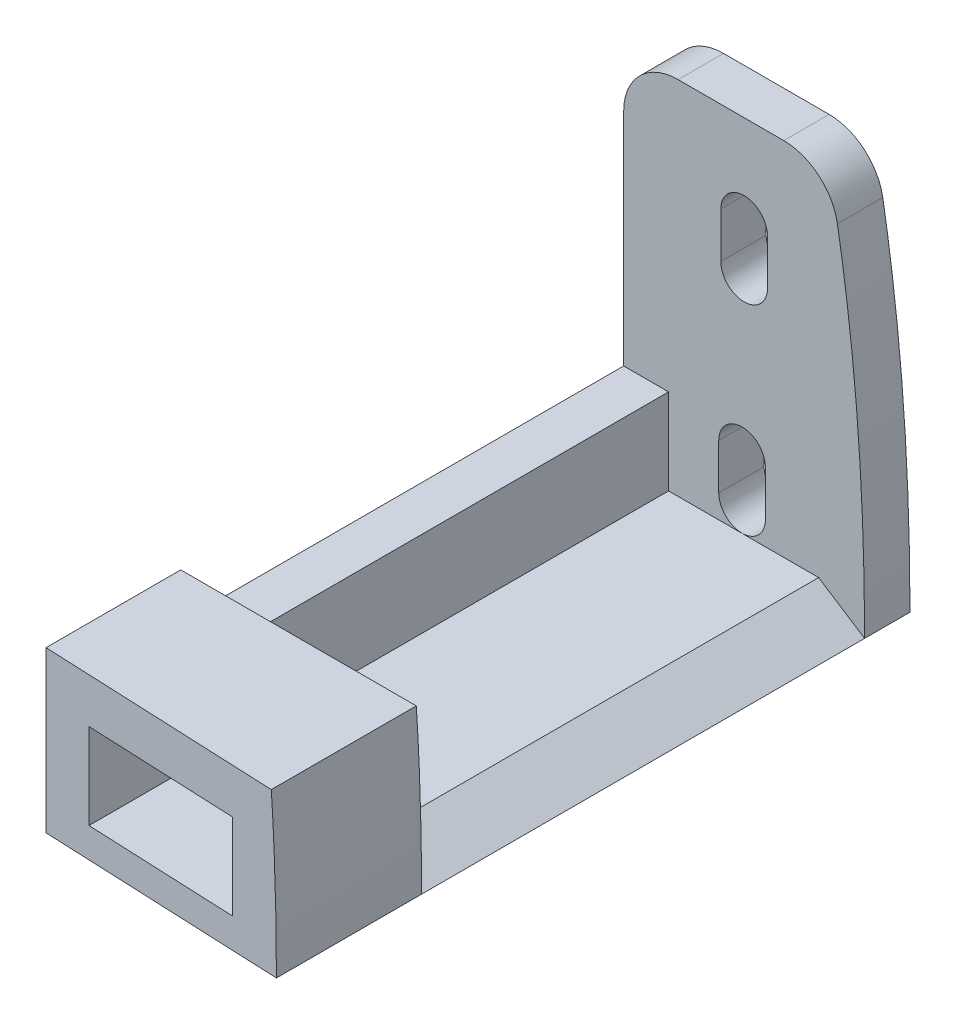
ISO-10303-21;
HEADER;
FILE_DESCRIPTION(('STEP AP214'),'2;1');
FILE_NAME('part.step','',(''),(''),'','','');
FILE_SCHEMA(('AUTOMOTIVE_DESIGN { 1 0 10303 214 1 1 1 1 }'));
ENDSEC;
DATA;
#1=APPLICATION_CONTEXT('core data for automotive mechanical design processes');
#2=APPLICATION_PROTOCOL_DEFINITION('international standard','automotive_design',2000,#1);
#3=PRODUCT_CONTEXT('',#1,'mechanical');
#4=PRODUCT('Part','Part','',(#3));
#5=PRODUCT_RELATED_PRODUCT_CATEGORY('part','',(#4));
#6=PRODUCT_DEFINITION_FORMATION('','',#4);
#7=PRODUCT_DEFINITION_CONTEXT('part definition',#1,'design');
#8=PRODUCT_DEFINITION('design','',#6,#7);
#9=PRODUCT_DEFINITION_SHAPE('','',#8);
#10=(LENGTH_UNIT() NAMED_UNIT(*) SI_UNIT(.MILLI.,.METRE.));
#11=(NAMED_UNIT(*) PLANE_ANGLE_UNIT() SI_UNIT($,.RADIAN.));
#12=(NAMED_UNIT(*) SI_UNIT($,.STERADIAN.) SOLID_ANGLE_UNIT());
#13=UNCERTAINTY_MEASURE_WITH_UNIT(LENGTH_MEASURE(1.E-05),#10,'distance_accuracy_value','');
#14=(GEOMETRIC_REPRESENTATION_CONTEXT(3) GLOBAL_UNCERTAINTY_ASSIGNED_CONTEXT((#13)) GLOBAL_UNIT_ASSIGNED_CONTEXT((#10,
#11,#12)) REPRESENTATION_CONTEXT('',''));
#15=CARTESIAN_POINT('',(0.,0.,0.));
#16=DIRECTION('',(0.,0.,1.));
#17=DIRECTION('',(1.,0.,0.));
#18=AXIS2_PLACEMENT_3D('',#15,#16,#17);
#19=CARTESIAN_POINT('',(0.,0.,0.));
#20=DIRECTION('',(0.,1.,0.));
#21=DIRECTION('',(-1.,0.,0.));
#22=AXIS2_PLACEMENT_3D('',#19,#20,#21);
#23=PLANE('',#22);
#24=DIRECTION('',(0.,0.,-1.));
#25=VECTOR('',#24,1.);
#26=CARTESIAN_POINT('',(76.7012027386837,0.,115.300012591128));
#27=LINE('',#26,#25);
#28=CARTESIAN_POINT('',(76.7012027386837,0.,34.165));
#29=VERTEX_POINT('',#28);
#30=CARTESIAN_POINT('',(76.7012027386837,0.,3.175));
#31=VERTEX_POINT('',#30);
#32=EDGE_CURVE('E229',#29,#31,#27,.T.);
#33=ORIENTED_EDGE('',*,*,#32,.F.);
#34=DIRECTION('',(0.,0.,1.));
#35=VECTOR('',#34,1.);
#36=CARTESIAN_POINT('',(76.7012027386837,0.,34.165));
#37=LINE('',#36,#35);
#38=CARTESIAN_POINT('',(76.7012027386837,1.90819582357449E-13,44.325));
#39=VERTEX_POINT('',#38);
#40=EDGE_CURVE('E12',#29,#39,#37,.T.);
#41=ORIENTED_EDGE('',*,*,#40,.T.);
#42=DIRECTION('',(0.999048221581858,0.,0.0436193873653289));
#43=VECTOR('',#42,1.);
#44=CARTESIAN_POINT('',(76.7012027386833,4.47558656802016E-13,44.325));
#45=LINE('',#44,#43);
#46=CARTESIAN_POINT('',(59.8466043155287,3.98986399474666E-13,43.5891123405009));
#47=VERTEX_POINT('',#46);
#48=EDGE_CURVE('E55',#47,#39,#45,.T.);
#49=ORIENTED_EDGE('',*,*,#48,.F.);
#50=DIRECTION('',(0.,0.,1.));
#51=VECTOR('',#50,1.);
#52=CARTESIAN_POINT('',(59.8466043155288,3.50414142147315E-13,3.175));
#53=LINE('',#52,#51);
#54=CARTESIAN_POINT('',(59.8466043155288,3.57353036051222E-13,0.));
#55=VERTEX_POINT('',#54);
#56=EDGE_CURVE('E203',#55,#47,#53,.T.);
#57=ORIENTED_EDGE('',*,*,#56,.F.);
#58=DIRECTION('',(-1.,0.,0.));
#59=VECTOR('',#58,1.);
#60=CARTESIAN_POINT('',(68.7014275349849,4.02455846426619E-13,0.));
#61=LINE('',#60,#59);
#62=CARTESIAN_POINT('',(76.7012027386837,0.,0.));
#63=VERTEX_POINT('',#62);
#64=EDGE_CURVE('E43',#63,#55,#61,.T.);
#65=ORIENTED_EDGE('',*,*,#64,.F.);
#66=DIRECTION('',(0.,0.,-1.));
#67=VECTOR('',#66,1.);
#68=CARTESIAN_POINT('',(76.7012027386837,0.,3.175));
#69=LINE('',#68,#67);
#70=EDGE_CURVE('E456',#31,#63,#69,.T.);
#71=ORIENTED_EDGE('',*,*,#70,.F.);
#72=EDGE_LOOP('',(#33,#41,#49,#57,#65,#71));
#73=FACE_BOUND('',#72,.T.);
#74=ADVANCED_FACE('F40',(#73),#23,.F.);
#75=CARTESIAN_POINT('',(69.760991774147,6.89682177302465,3.175));
#76=DIRECTION('',(-1.,0.,0.));
#77=DIRECTION('',(0.,0.,1.));
#78=AXIS2_PLACEMENT_3D('',#75,#76,#77);
#79=PLANE('',#78);
#80=DIRECTION('',(0.,1.,0.));
#81=VECTOR('',#80,1.);
#82=CARTESIAN_POINT('',(69.760991774147,6.89682177302465,0.));
#83=LINE('',#82,#81);
#84=CARTESIAN_POINT('',(69.760991774147,3.72182177302465,0.));
#85=VERTEX_POINT('',#84);
#86=CARTESIAN_POINT('',(69.760991774147,6.89682177302465,0.));
#87=VERTEX_POINT('',#86);
#88=EDGE_CURVE('E258',#85,#87,#83,.T.);
#89=ORIENTED_EDGE('',*,*,#88,.F.);
#90=DIRECTION('',(0.,0.,-1.));
#91=VECTOR('',#90,1.);
#92=CARTESIAN_POINT('',(69.760991774147,3.72182177302465,3.175));
#93=LINE('',#92,#91);
#94=CARTESIAN_POINT('',(69.760991774147,3.72182177302465,3.175));
#95=VERTEX_POINT('',#94);
#96=EDGE_CURVE('E278',#95,#85,#93,.T.);
#97=ORIENTED_EDGE('',*,*,#96,.F.);
#98=DIRECTION('',(0.,1.,0.));
#99=VECTOR('',#98,1.);
#100=CARTESIAN_POINT('',(69.760991774147,6.89682177302465,3.175));
#101=LINE('',#100,#99);
#102=CARTESIAN_POINT('',(69.760991774147,6.89682177302465,3.175));
#103=VERTEX_POINT('',#102);
#104=EDGE_CURVE('E263',#95,#103,#101,.T.);
#105=ORIENTED_EDGE('',*,*,#104,.T.);
#106=DIRECTION('',(0.,0.,-1.));
#107=VECTOR('',#106,1.);
#108=CARTESIAN_POINT('',(69.760991774147,6.89682177302465,3.175));
#109=LINE('',#108,#107);
#110=EDGE_CURVE('E265',#103,#87,#109,.T.);
#111=ORIENTED_EDGE('',*,*,#110,.T.);
#112=EDGE_LOOP('',(#89,#97,#105,#111));
#113=FACE_BOUND('',#112,.T.);
#114=ADVANCED_FACE('F385',(#113),#79,.T.);
#115=CARTESIAN_POINT('',(68.129041774147,3.72182177302465,3.175));
#116=DIRECTION('',(0.,0.,-1.));
#117=DIRECTION('',(-1.,0.,0.));
#118=AXIS2_PLACEMENT_3D('',#115,#116,#117);
#119=CYLINDRICAL_SURFACE('',#118,1.63194999999999);
#120=CARTESIAN_POINT('',(68.129041774147,3.72182177302465,0.));
#121=DIRECTION('',(0.,0.,1.));
#122=DIRECTION('',(-1.,0.,0.));
#123=AXIS2_PLACEMENT_3D('',#120,#121,#122);
#124=CIRCLE('',#123,1.63194999999999);
#125=CARTESIAN_POINT('',(66.497091774147,3.72182177302465,0.));
#126=VERTEX_POINT('',#125);
#127=EDGE_CURVE('E271',#126,#85,#124,.T.);
#128=ORIENTED_EDGE('',*,*,#127,.F.);
#129=DIRECTION('',(0.,0.,-1.));
#130=VECTOR('',#129,1.);
#131=CARTESIAN_POINT('',(66.497091774147,3.72182177302465,3.175));
#132=LINE('',#131,#130);
#133=CARTESIAN_POINT('',(66.497091774147,3.72182177302465,3.175));
#134=VERTEX_POINT('',#133);
#135=EDGE_CURVE('E280',#134,#126,#132,.T.);
#136=ORIENTED_EDGE('',*,*,#135,.F.);
#137=CARTESIAN_POINT('',(68.129041774147,3.72182177302465,3.175));
#138=DIRECTION('',(0.,0.,1.));
#139=DIRECTION('',(-1.,0.,0.));
#140=AXIS2_PLACEMENT_3D('',#137,#138,#139);
#141=CIRCLE('',#140,1.63194999999999);
#142=EDGE_CURVE('E260',#134,#95,#141,.T.);
#143=ORIENTED_EDGE('',*,*,#142,.T.);
#144=ORIENTED_EDGE('',*,*,#96,.T.);
#145=EDGE_LOOP('',(#128,#136,#143,#144));
#146=FACE_BOUND('',#145,.T.);
#147=ADVANCED_FACE('F381',(#146),#119,.F.);
#148=CARTESIAN_POINT('',(66.497091774147,6.89682177302465,3.175));
#149=DIRECTION('',(1.,0.,0.));
#150=DIRECTION('',(0.,0.,-1.));
#151=AXIS2_PLACEMENT_3D('',#148,#149,#150);
#152=PLANE('',#151);
#153=DIRECTION('',(0.,-1.,0.));
#154=VECTOR('',#153,1.);
#155=CARTESIAN_POINT('',(66.497091774147,6.89682177302465,0.));
#156=LINE('',#155,#154);
#157=CARTESIAN_POINT('',(66.497091774147,6.89682177302465,0.));
#158=VERTEX_POINT('',#157);
#159=EDGE_CURVE('E268',#158,#126,#156,.T.);
#160=ORIENTED_EDGE('',*,*,#159,.F.);
#161=DIRECTION('',(0.,0.,-1.));
#162=VECTOR('',#161,1.);
#163=CARTESIAN_POINT('',(66.497091774147,6.89682177302465,3.175));
#164=LINE('',#163,#162);
#165=CARTESIAN_POINT('',(66.497091774147,6.89682177302465,3.175));
#166=VERTEX_POINT('',#165);
#167=EDGE_CURVE('E282',#166,#158,#164,.T.);
#168=ORIENTED_EDGE('',*,*,#167,.F.);
#169=DIRECTION('',(0.,-1.,0.));
#170=VECTOR('',#169,1.);
#171=CARTESIAN_POINT('',(66.497091774147,6.89682177302465,3.175));
#172=LINE('',#171,#170);
#173=EDGE_CURVE('E257',#166,#134,#172,.T.);
#174=ORIENTED_EDGE('',*,*,#173,.T.);
#175=ORIENTED_EDGE('',*,*,#135,.T.);
#176=EDGE_LOOP('',(#160,#168,#174,#175));
#177=FACE_BOUND('',#176,.T.);
#178=ADVANCED_FACE('F377',(#177),#152,.T.);
#179=CARTESIAN_POINT('',(68.129041774147,6.89682177302465,3.175));
#180=DIRECTION('',(0.,0.,-1.));
#181=DIRECTION('',(-1.,0.,0.));
#182=AXIS2_PLACEMENT_3D('',#179,#180,#181);
#183=CYLINDRICAL_SURFACE('',#182,1.63194999999999);
#184=CARTESIAN_POINT('',(68.129041774147,6.89682177302465,0.));
#185=DIRECTION('',(0.,0.,1.));
#186=DIRECTION('',(-1.,0.,0.));
#187=AXIS2_PLACEMENT_3D('',#184,#185,#186);
#188=CIRCLE('',#187,1.63194999999999);
#189=EDGE_CURVE('E244',#87,#158,#188,.T.);
#190=ORIENTED_EDGE('',*,*,#189,.F.);
#191=ORIENTED_EDGE('',*,*,#110,.F.);
#192=CARTESIAN_POINT('',(68.129041774147,6.89682177302465,3.175));
#193=DIRECTION('',(0.,0.,1.));
#194=DIRECTION('',(-1.,0.,0.));
#195=AXIS2_PLACEMENT_3D('',#192,#193,#194);
#196=CIRCLE('',#195,1.63194999999999);
#197=EDGE_CURVE('E255',#103,#166,#196,.T.);
#198=ORIENTED_EDGE('',*,*,#197,.T.);
#199=ORIENTED_EDGE('',*,*,#167,.T.);
#200=EDGE_LOOP('',(#190,#191,#198,#199));
#201=FACE_BOUND('',#200,.T.);
#202=ADVANCED_FACE('F344',(#201),#183,.F.);
#203=CARTESIAN_POINT('',(71.0455447158619,27.3353946469676,3.175));
#204=DIRECTION('',(0.,-1.,0.));
#205=DIRECTION('',(1.,0.,0.));
#206=AXIS2_PLACEMENT_3D('',#203,#204,#205);
#207=PLANE('',#206);
#208=DIRECTION('',(-1.,0.,0.));
#209=VECTOR('',#208,1.);
#210=CARTESIAN_POINT('',(71.0455447158619,27.3353946469676,0.));
#211=LINE('',#210,#209);
#212=CARTESIAN_POINT('',(71.0455447158619,27.3353946469676,0.));
#213=VERTEX_POINT('',#212);
#214=CARTESIAN_POINT('',(63.6566043155288,27.3353946469676,0.));
#215=VERTEX_POINT('',#214);
#216=EDGE_CURVE('E508',#213,#215,#211,.T.);
#217=ORIENTED_EDGE('',*,*,#216,.T.);
#218=DIRECTION('',(0.,0.,-1.));
#219=VECTOR('',#218,1.);
#220=CARTESIAN_POINT('',(63.6566043155288,27.3353946469676,3.175));
#221=LINE('',#220,#219);
#222=CARTESIAN_POINT('',(63.6566043155288,27.3353946469676,3.175));
#223=VERTEX_POINT('',#222);
#224=EDGE_CURVE('E498',#223,#215,#221,.T.);
#225=ORIENTED_EDGE('',*,*,#224,.F.);
#226=DIRECTION('',(-1.,0.,0.));
#227=VECTOR('',#226,1.);
#228=CARTESIAN_POINT('',(71.0455447158619,27.3353946469676,3.175));
#229=LINE('',#228,#227);
#230=CARTESIAN_POINT('',(71.0455447158619,27.3353946469676,3.175));
#231=VERTEX_POINT('',#230);
#232=EDGE_CURVE('E526',#231,#223,#229,.T.);
#233=ORIENTED_EDGE('',*,*,#232,.F.);
#234=DIRECTION('',(0.,0.,-1.));
#235=VECTOR('',#234,1.);
#236=CARTESIAN_POINT('',(71.0455447158619,27.3353946469676,3.175));
#237=LINE('',#236,#235);
#238=EDGE_CURVE('E494',#231,#213,#237,.T.);
#239=ORIENTED_EDGE('',*,*,#238,.T.);
#240=EDGE_LOOP('',(#217,#225,#233,#239));
#241=FACE_BOUND('',#240,.T.);
#242=ADVANCED_FACE('F340',(#241),#207,.F.);
#243=CARTESIAN_POINT('',(69.9058535271063,20.9853946469675,3.175));
#244=DIRECTION('',(-1.,0.,0.));
#245=DIRECTION('',(0.,0.,1.));
#246=AXIS2_PLACEMENT_3D('',#243,#244,#245);
#247=PLANE('',#246);
#248=DIRECTION('',(0.,1.,0.));
#249=VECTOR('',#248,1.);
#250=CARTESIAN_POINT('',(69.9058535271063,20.9853946469675,0.));
#251=LINE('',#250,#249);
#252=CARTESIAN_POINT('',(69.9058535271063,17.8103946469675,0.));
#253=VERTEX_POINT('',#252);
#254=CARTESIAN_POINT('',(69.9058535271063,20.9853946469675,0.));
#255=VERTEX_POINT('',#254);
#256=EDGE_CURVE('E289',#253,#255,#251,.T.);
#257=ORIENTED_EDGE('',*,*,#256,.F.);
#258=DIRECTION('',(0.,0.,-1.));
#259=VECTOR('',#258,1.);
#260=CARTESIAN_POINT('',(69.9058535271063,17.8103946469675,3.175));
#261=LINE('',#260,#259);
#262=CARTESIAN_POINT('',(69.9058535271063,17.8103946469675,3.175));
#263=VERTEX_POINT('',#262);
#264=EDGE_CURVE('E309',#263,#253,#261,.T.);
#265=ORIENTED_EDGE('',*,*,#264,.F.);
#266=DIRECTION('',(0.,1.,0.));
#267=VECTOR('',#266,1.);
#268=CARTESIAN_POINT('',(69.9058535271063,20.9853946469675,3.175));
#269=LINE('',#268,#267);
#270=CARTESIAN_POINT('',(69.9058535271063,20.9853946469675,3.175));
#271=VERTEX_POINT('',#270);
#272=EDGE_CURVE('E294',#263,#271,#269,.T.);
#273=ORIENTED_EDGE('',*,*,#272,.T.);
#274=DIRECTION('',(0.,0.,-1.));
#275=VECTOR('',#274,1.);
#276=CARTESIAN_POINT('',(69.9058535271063,20.9853946469675,3.175));
#277=LINE('',#276,#275);
#278=EDGE_CURVE('E296',#271,#255,#277,.T.);
#279=ORIENTED_EDGE('',*,*,#278,.T.);
#280=EDGE_LOOP('',(#257,#265,#273,#279));
#281=FACE_BOUND('',#280,.T.);
#282=ADVANCED_FACE('F343',(#281),#247,.T.);
#283=CARTESIAN_POINT('',(68.2739035271063,17.8103946469675,3.175));
#284=DIRECTION('',(0.,0.,-1.));
#285=DIRECTION('',(-1.,0.,0.));
#286=AXIS2_PLACEMENT_3D('',#283,#284,#285);
#287=CYLINDRICAL_SURFACE('',#286,1.63194999999999);
#288=CARTESIAN_POINT('',(68.2739035271063,17.8103946469675,0.));
#289=DIRECTION('',(0.,0.,1.));
#290=DIRECTION('',(-1.,0.,0.));
#291=AXIS2_PLACEMENT_3D('',#288,#289,#290);
#292=CIRCLE('',#291,1.63194999999999);
#293=CARTESIAN_POINT('',(66.6419535271063,17.8103946469675,0.));
#294=VERTEX_POINT('',#293);
#295=EDGE_CURVE('E302',#294,#253,#292,.T.);
#296=ORIENTED_EDGE('',*,*,#295,.F.);
#297=DIRECTION('',(0.,0.,-1.));
#298=VECTOR('',#297,1.);
#299=CARTESIAN_POINT('',(66.6419535271063,17.8103946469675,3.175));
#300=LINE('',#299,#298);
#301=CARTESIAN_POINT('',(66.6419535271063,17.8103946469675,3.175));
#302=VERTEX_POINT('',#301);
#303=EDGE_CURVE('E311',#302,#294,#300,.T.);
#304=ORIENTED_EDGE('',*,*,#303,.F.);
#305=CARTESIAN_POINT('',(68.2739035271063,17.8103946469675,3.175));
#306=DIRECTION('',(0.,0.,1.));
#307=DIRECTION('',(-1.,0.,0.));
#308=AXIS2_PLACEMENT_3D('',#305,#306,#307);
#309=CIRCLE('',#308,1.63194999999999);
#310=EDGE_CURVE('E291',#302,#263,#309,.T.);
#311=ORIENTED_EDGE('',*,*,#310,.T.);
#312=ORIENTED_EDGE('',*,*,#264,.T.);
#313=EDGE_LOOP('',(#296,#304,#311,#312));
#314=FACE_BOUND('',#313,.T.);
#315=ADVANCED_FACE('F367',(#314),#287,.F.);
#316=CARTESIAN_POINT('',(66.6419535271063,20.9853946469675,3.175));
#317=DIRECTION('',(1.,0.,0.));
#318=DIRECTION('',(0.,0.,-1.));
#319=AXIS2_PLACEMENT_3D('',#316,#317,#318);
#320=PLANE('',#319);
#321=DIRECTION('',(0.,-1.,0.));
#322=VECTOR('',#321,1.);
#323=CARTESIAN_POINT('',(66.6419535271063,20.9853946469675,0.));
#324=LINE('',#323,#322);
#325=CARTESIAN_POINT('',(66.6419535271063,20.9853946469675,0.));
#326=VERTEX_POINT('',#325);
#327=EDGE_CURVE('E299',#326,#294,#324,.T.);
#328=ORIENTED_EDGE('',*,*,#327,.F.);
#329=DIRECTION('',(0.,0.,-1.));
#330=VECTOR('',#329,1.);
#331=CARTESIAN_POINT('',(66.6419535271063,20.9853946469675,3.175));
#332=LINE('',#331,#330);
#333=CARTESIAN_POINT('',(66.6419535271063,20.9853946469675,3.175));
#334=VERTEX_POINT('',#333);
#335=EDGE_CURVE('E313',#334,#326,#332,.T.);
#336=ORIENTED_EDGE('',*,*,#335,.F.);
#337=DIRECTION('',(0.,-1.,0.));
#338=VECTOR('',#337,1.);
#339=CARTESIAN_POINT('',(66.6419535271063,20.9853946469675,3.175));
#340=LINE('',#339,#338);
#341=EDGE_CURVE('E288',#334,#302,#340,.T.);
#342=ORIENTED_EDGE('',*,*,#341,.T.);
#343=ORIENTED_EDGE('',*,*,#303,.T.);
#344=EDGE_LOOP('',(#328,#336,#342,#343));
#345=FACE_BOUND('',#344,.T.);
#346=ADVANCED_FACE('F363',(#345),#320,.T.);
#347=CARTESIAN_POINT('',(68.2739035271063,20.9853946469675,3.175));
#348=DIRECTION('',(0.,0.,-1.));
#349=DIRECTION('',(-1.,0.,0.));
#350=AXIS2_PLACEMENT_3D('',#347,#348,#349);
#351=CYLINDRICAL_SURFACE('',#350,1.63194999999999);
#352=CARTESIAN_POINT('',(68.2739035271063,20.9853946469675,0.));
#353=DIRECTION('',(0.,0.,1.));
#354=DIRECTION('',(-1.,0.,0.));
#355=AXIS2_PLACEMENT_3D('',#352,#353,#354);
#356=CIRCLE('',#355,1.63194999999999);
#357=EDGE_CURVE('E285',#255,#326,#356,.T.);
#358=ORIENTED_EDGE('',*,*,#357,.F.);
#359=ORIENTED_EDGE('',*,*,#278,.F.);
#360=CARTESIAN_POINT('',(68.2739035271063,20.9853946469675,3.175));
#361=DIRECTION('',(0.,0.,1.));
#362=DIRECTION('',(-1.,0.,0.));
#363=AXIS2_PLACEMENT_3D('',#360,#361,#362);
#364=CIRCLE('',#363,1.63194999999999);
#365=EDGE_CURVE('E286',#271,#334,#364,.T.);
#366=ORIENTED_EDGE('',*,*,#365,.T.);
#367=ORIENTED_EDGE('',*,*,#335,.T.);
#368=EDGE_LOOP('',(#358,#359,#366,#367));
#369=FACE_BOUND('',#368,.T.);
#370=ADVANCED_FACE('F350',(#369),#351,.F.);
#371=CARTESIAN_POINT('',(63.6566043155288,23.5253946469676,3.175));
#372=DIRECTION('',(0.,0.,-1.));
#373=DIRECTION('',(-1.,0.,0.));
#374=AXIS2_PLACEMENT_3D('',#371,#372,#373);
#375=CYLINDRICAL_SURFACE('',#374,3.81);
#376=CARTESIAN_POINT('',(63.6566043155288,23.5253946469676,0.));
#377=DIRECTION('',(0.,0.,1.));
#378=DIRECTION('',(1.,0.,0.));
#379=AXIS2_PLACEMENT_3D('',#376,#377,#378);
#380=CIRCLE('',#379,3.81);
#381=CARTESIAN_POINT('',(59.8466043155288,23.5253946469675,0.));
#382=VERTEX_POINT('',#381);
#383=EDGE_CURVE('E506',#215,#382,#380,.T.);
#384=ORIENTED_EDGE('',*,*,#383,.T.);
#385=DIRECTION('',(0.,0.,-1.));
#386=VECTOR('',#385,1.);
#387=CARTESIAN_POINT('',(59.8466043155288,23.5253946469675,3.175));
#388=LINE('',#387,#386);
#389=CARTESIAN_POINT('',(59.8466043155288,23.5253946469675,3.175));
#390=VERTEX_POINT('',#389);
#391=EDGE_CURVE('E505',#390,#382,#388,.T.);
#392=ORIENTED_EDGE('',*,*,#391,.F.);
#393=CARTESIAN_POINT('',(63.6566043155288,23.5253946469676,3.175));
#394=DIRECTION('',(0.,0.,1.));
#395=DIRECTION('',(1.,0.,0.));
#396=AXIS2_PLACEMENT_3D('',#393,#394,#395);
#397=CIRCLE('',#396,3.81);
#398=EDGE_CURVE('E470',#223,#390,#397,.T.);
#399=ORIENTED_EDGE('',*,*,#398,.F.);
#400=ORIENTED_EDGE('',*,*,#224,.T.);
#401=EDGE_LOOP('',(#384,#392,#399,#400));
#402=FACE_BOUND('',#401,.T.);
#403=ADVANCED_FACE('F346',(#402),#375,.T.);
#404=CARTESIAN_POINT('',(0.,8.08,115.300012591128));
#405=DIRECTION('',(0.,-1.,0.));
#406=DIRECTION('',(0.,0.,-1.));
#407=AXIS2_PLACEMENT_3D('',#404,#405,#406);
#408=PLANE('',#407);
#409=DIRECTION('',(-1.,0.,0.));
#410=VECTOR('',#409,1.);
#411=CARTESIAN_POINT('',(0.,8.08,34.165));
#412=LINE('',#411,#410);
#413=CARTESIAN_POINT('',(62.9870106240419,8.08,34.165));
#414=VERTEX_POINT('',#413);
#415=CARTESIAN_POINT('',(59.8466043155288,8.08,34.165));
#416=VERTEX_POINT('',#415);
#417=EDGE_CURVE('E217',#414,#416,#412,.T.);
#418=ORIENTED_EDGE('',*,*,#417,.F.);
#419=DIRECTION('',(0.,0.,-1.));
#420=VECTOR('',#419,1.);
#421=CARTESIAN_POINT('',(62.9870106240419,8.08,115.300012591128));
#422=LINE('',#421,#420);
#423=CARTESIAN_POINT('',(62.9870106240419,8.08,3.175));
#424=VERTEX_POINT('',#423);
#425=EDGE_CURVE('E252',#414,#424,#422,.T.);
#426=ORIENTED_EDGE('',*,*,#425,.T.);
#427=DIRECTION('',(-1.,0.,0.));
#428=VECTOR('',#427,1.);
#429=CARTESIAN_POINT('',(0.,8.08,3.175));
#430=LINE('',#429,#428);
#431=CARTESIAN_POINT('',(59.8466043155288,8.08,3.175));
#432=VERTEX_POINT('',#431);
#433=EDGE_CURVE('E230',#424,#432,#430,.T.);
#434=ORIENTED_EDGE('',*,*,#433,.T.);
#435=DIRECTION('',(0.,0.,-1.));
#436=VECTOR('',#435,1.);
#437=CARTESIAN_POINT('',(59.8466043155288,8.08,115.300012591128));
#438=LINE('',#437,#436);
#439=EDGE_CURVE('E233',#416,#432,#438,.T.);
#440=ORIENTED_EDGE('',*,*,#439,.F.);
#441=EDGE_LOOP('',(#418,#426,#434,#440));
#442=FACE_BOUND('',#441,.T.);
#443=ADVANCED_FACE('F349',(#442),#408,.F.);
#444=CARTESIAN_POINT('',(68.7014275349846,44.7155879948714,3.175));
#445=DIRECTION('',(0.,0.,1.));
#446=DIRECTION('',(1.,0.,0.));
#447=AXIS2_PLACEMENT_3D('',#444,#445,#446);
#448=PLANE('',#447);
#449=ORIENTED_EDGE('',*,*,#433,.F.);
#450=DIRECTION('',(0.,-1.,0.));
#451=VECTOR('',#450,1.);
#452=CARTESIAN_POINT('',(62.9870106240419,0.,3.175));
#453=LINE('',#452,#451);
#454=CARTESIAN_POINT('',(62.9870106240419,2.08,3.175));
#455=VERTEX_POINT('',#454);
#456=EDGE_CURVE('E235',#424,#455,#453,.T.);
#457=ORIENTED_EDGE('',*,*,#456,.T.);
#458=DIRECTION('',(1.,0.,0.));
#459=VECTOR('',#458,1.);
#460=CARTESIAN_POINT('',(0.,2.08,3.175));
#461=LINE('',#460,#459);
#462=CARTESIAN_POINT('',(73.4870106240419,2.07999999999999,3.175));
#463=VERTEX_POINT('',#462);
#464=EDGE_CURVE('E238',#455,#463,#461,.T.);
#465=ORIENTED_EDGE('',*,*,#464,.T.);
#466=DIRECTION('',(0.839542918720569,-0.543293371601521,0.));
#467=VECTOR('',#466,1.);
#468=CARTESIAN_POINT('',(22.6397166505216,34.9848070845347,3.175));
#469=LINE('',#468,#467);
#470=EDGE_CURVE('E241',#463,#31,#469,.T.);
#471=ORIENTED_EDGE('',*,*,#470,.T.);
#472=CARTESIAN_POINT('',(76.7012027386837,0.,3.175));
#473=CARTESIAN_POINT('',(76.7012027386837,30.9296667453578,3.175));
#474=CARTESIAN_POINT('',(68.7186340367103,64.8229846207152,3.175));
#475=CARTESIAN_POINT('',(36.6507072150114,70.4667498607525,3.175));
#476=B_SPLINE_CURVE_WITH_KNOTS('',3,(#472,#473,#474,#475),.UNSPECIFIED.,.F.,.F.,(4,4),(0.,1.),.UNSPECIFIED.);
#477=CARTESIAN_POINT('',(74.8000729288326,24.1731738516406,3.175));
#478=VERTEX_POINT('',#477);
#479=EDGE_CURVE('E317',#31,#478,#476,.T.);
#480=ORIENTED_EDGE('',*,*,#479,.T.);
#481=CARTESIAN_POINT('',(71.0455447158619,23.5253946469676,3.175));
#482=DIRECTION('',(0.,0.,1.));
#483=DIRECTION('',(-1.,0.,0.));
#484=AXIS2_PLACEMENT_3D('',#481,#482,#483);
#485=CIRCLE('',#484,3.81);
#486=EDGE_CURVE('E323',#478,#231,#485,.T.);
#487=ORIENTED_EDGE('',*,*,#486,.T.);
#488=ORIENTED_EDGE('',*,*,#232,.T.);
#489=ORIENTED_EDGE('',*,*,#398,.T.);
#490=DIRECTION('',(0.,-1.,0.));
#491=VECTOR('',#490,1.);
#492=CARTESIAN_POINT('',(59.8466043155288,23.5253946469675,3.175));
#493=LINE('',#492,#491);
#494=EDGE_CURVE('E465',#390,#432,#493,.T.);
#495=ORIENTED_EDGE('',*,*,#494,.T.);
#496=EDGE_LOOP('',(#449,#457,#465,#471,#480,#487,#488,#489,#495));
#497=FACE_BOUND('',#496,.T.);
#498=ORIENTED_EDGE('',*,*,#341,.F.);
#499=ORIENTED_EDGE('',*,*,#365,.F.);
#500=ORIENTED_EDGE('',*,*,#272,.F.);
#501=ORIENTED_EDGE('',*,*,#310,.F.);
#502=EDGE_LOOP('',(#498,#499,#500,#501));
#503=FACE_BOUND('',#502,.T.);
#504=ORIENTED_EDGE('',*,*,#173,.F.);
#505=ORIENTED_EDGE('',*,*,#197,.F.);
#506=ORIENTED_EDGE('',*,*,#104,.F.);
#507=ORIENTED_EDGE('',*,*,#142,.F.);
#508=EDGE_LOOP('',(#504,#505,#506,#507));
#509=FACE_BOUND('',#508,.T.);
#510=ADVANCED_FACE('F338',(#497,#503,#509),#448,.T.);
#511=CARTESIAN_POINT('',(71.0455447158619,23.5253946469676,3.175));
#512=DIRECTION('',(0.,0.,-1.));
#513=DIRECTION('',(-1.,0.,0.));
#514=AXIS2_PLACEMENT_3D('',#511,#512,#513);
#515=CYLINDRICAL_SURFACE('',#514,3.81);
#516=CARTESIAN_POINT('',(71.0455447158619,23.5253946469676,0.));
#517=DIRECTION('',(0.,0.,1.));
#518=DIRECTION('',(-1.,0.,0.));
#519=AXIS2_PLACEMENT_3D('',#516,#517,#518);
#520=CIRCLE('',#519,3.81);
#521=CARTESIAN_POINT('',(74.8000729288326,24.1731738516406,0.));
#522=VERTEX_POINT('',#521);
#523=EDGE_CURVE('E517',#522,#213,#520,.T.);
#524=ORIENTED_EDGE('',*,*,#523,.T.);
#525=ORIENTED_EDGE('',*,*,#238,.F.);
#526=ORIENTED_EDGE('',*,*,#486,.F.);
#527=DIRECTION('',(0.,0.,-1.));
#528=VECTOR('',#527,1.);
#529=CARTESIAN_POINT('',(74.8000729288326,24.1731738516406,3.175));
#530=LINE('',#529,#528);
#531=EDGE_CURVE('E492',#478,#522,#530,.T.);
#532=ORIENTED_EDGE('',*,*,#531,.T.);
#533=EDGE_LOOP('',(#524,#525,#526,#532));
#534=FACE_BOUND('',#533,.T.);
#535=ADVANCED_FACE('F335',(#534),#515,.T.);
#536=CARTESIAN_POINT('',(68.7014275349846,44.7155879948714,0.));
#537=DIRECTION('',(0.,0.,1.));
#538=DIRECTION('',(1.,0.,0.));
#539=AXIS2_PLACEMENT_3D('',#536,#537,#538);
#540=PLANE('',#539);
#541=ORIENTED_EDGE('',*,*,#357,.T.);
#542=ORIENTED_EDGE('',*,*,#327,.T.);
#543=ORIENTED_EDGE('',*,*,#295,.T.);
#544=ORIENTED_EDGE('',*,*,#256,.T.);
#545=EDGE_LOOP('',(#541,#542,#543,#544));
#546=FACE_BOUND('',#545,.T.);
#547=CARTESIAN_POINT('',(76.7012027386837,0.,0.));
#548=CARTESIAN_POINT('',(76.7012027386837,30.9296667453578,0.));
#549=CARTESIAN_POINT('',(68.7186340367103,64.8229846207152,0.));
#550=CARTESIAN_POINT('',(36.6507072150114,70.4667498607525,0.));
#551=B_SPLINE_CURVE_WITH_KNOTS('',3,(#547,#548,#549,#550),.UNSPECIFIED.,.F.,.F.,(4,4),(0.,1.),.UNSPECIFIED.);
#552=EDGE_CURVE('E316',#63,#522,#551,.T.);
#553=ORIENTED_EDGE('',*,*,#552,.F.);
#554=ORIENTED_EDGE('',*,*,#64,.T.);
#555=DIRECTION('',(0.,-1.,0.));
#556=VECTOR('',#555,1.);
#557=CARTESIAN_POINT('',(59.8466043155288,23.5253946469675,0.));
#558=LINE('',#557,#556);
#559=EDGE_CURVE('E324',#382,#55,#558,.T.);
#560=ORIENTED_EDGE('',*,*,#559,.F.);
#561=ORIENTED_EDGE('',*,*,#383,.F.);
#562=ORIENTED_EDGE('',*,*,#216,.F.);
#563=ORIENTED_EDGE('',*,*,#523,.F.);
#564=EDGE_LOOP('',(#553,#554,#560,#561,#562,#563));
#565=FACE_BOUND('',#564,.T.);
#566=ORIENTED_EDGE('',*,*,#189,.T.);
#567=ORIENTED_EDGE('',*,*,#159,.T.);
#568=ORIENTED_EDGE('',*,*,#127,.T.);
#569=ORIENTED_EDGE('',*,*,#88,.T.);
#570=EDGE_LOOP('',(#566,#567,#568,#569));
#571=FACE_BOUND('',#570,.T.);
#572=ADVANCED_FACE('F333',(#546,#565,#571),#540,.F.);
#573=DIRECTION('',(0.,0.,-1.));
#574=VECTOR('',#573,1.);
#575=SURFACE_OF_LINEAR_EXTRUSION('',#476,#574);
#576=ORIENTED_EDGE('',*,*,#552,.T.);
#577=ORIENTED_EDGE('',*,*,#531,.F.);
#578=ORIENTED_EDGE('',*,*,#479,.F.);
#579=ORIENTED_EDGE('',*,*,#70,.T.);
#580=EDGE_LOOP('',(#576,#577,#578,#579));
#581=FACE_BOUND('',#580,.T.);
#582=ADVANCED_FACE('F329',(#581),#575,.F.);
#583=CARTESIAN_POINT('',(76.6113232522094,-5.59841845242116,34.165));
#584=DIRECTION('',(0.,0.,1.));
#585=DIRECTION('',(1.,0.,0.));
#586=AXIS2_PLACEMENT_3D('',#583,#584,#585);
#587=PLANE('',#586);
#588=DIRECTION('',(0.839542918720569,-0.543293371601521,0.));
#589=VECTOR('',#588,1.);
#590=CARTESIAN_POINT('',(22.6397166505216,34.9848070845347,34.165));
#591=LINE('',#590,#589);
#592=CARTESIAN_POINT('',(73.4870106240419,2.07999999999999,34.165));
#593=VERTEX_POINT('',#592);
#594=EDGE_CURVE('E221',#593,#29,#591,.T.);
#595=ORIENTED_EDGE('',*,*,#594,.F.);
#596=DIRECTION('',(0.,1.,0.));
#597=VECTOR('',#596,1.);
#598=CARTESIAN_POINT('',(73.4870106240419,8.08,34.165));
#599=LINE('',#598,#597);
#600=CARTESIAN_POINT('',(73.4870106240419,8.08,34.165));
#601=VERTEX_POINT('',#600);
#602=EDGE_CURVE('E427',#593,#601,#599,.T.);
#603=ORIENTED_EDGE('',*,*,#602,.T.);
#604=DIRECTION('',(-1.,0.,0.));
#605=VECTOR('',#604,1.);
#606=CARTESIAN_POINT('',(62.9870106240419,8.08,34.165));
#607=LINE('',#606,#605);
#608=EDGE_CURVE('E424',#601,#414,#607,.T.);
#609=ORIENTED_EDGE('',*,*,#608,.T.);
#610=ORIENTED_EDGE('',*,*,#417,.T.);
#611=DIRECTION('',(0.,-1.,0.));
#612=VECTOR('',#611,1.);
#613=CARTESIAN_POINT('',(59.8466043155288,8.08,34.165));
#614=LINE('',#613,#612);
#615=CARTESIAN_POINT('',(59.8466043155288,11.2204063085131,34.165));
#616=VERTEX_POINT('',#615);
#617=EDGE_CURVE('E416',#616,#416,#614,.T.);
#618=ORIENTED_EDGE('',*,*,#617,.F.);
#619=DIRECTION('',(-1.,1.03928950505966E-12,0.));
#620=VECTOR('',#619,1.);
#621=CARTESIAN_POINT('',(59.8466043155288,11.2204063085131,34.165));
#622=LINE('',#621,#620);
#623=CARTESIAN_POINT('',(76.3277286975284,11.2204063084959,34.165));
#624=VERTEX_POINT('',#623);
#625=EDGE_CURVE('E216',#624,#616,#622,.T.);
#626=ORIENTED_EDGE('',*,*,#625,.F.);
#627=CARTESIAN_POINT('',(76.7012027386837,0.,34.165));
#628=CARTESIAN_POINT('',(76.7012027386837,3.71540513009788,34.165));
#629=CARTESIAN_POINT('',(76.5860154551374,7.47357530686041,34.165));
#630=CARTESIAN_POINT('',(76.3277286975284,11.2204063084959,34.165));
#631=B_SPLINE_CURVE_WITH_KNOTS('',3,(#627,#628,#629,#630),.UNSPECIFIED.,.F.,.F.,(4,4),(0.,
0.120124318205126),.UNSPECIFIED.);
#632=EDGE_CURVE('E411',#29,#624,#631,.T.);
#633=ORIENTED_EDGE('',*,*,#632,.F.);
#634=EDGE_LOOP('',(#595,#603,#609,#610,#618,#626,#633));
#635=FACE_BOUND('',#634,.T.);
#636=ADVANCED_FACE('F332',(#635),#587,.F.);
#637=CARTESIAN_POINT('',(73.4870106240419,8.08,34.165));
#638=DIRECTION('',(1.,0.,0.));
#639=DIRECTION('',(0.,1.,0.));
#640=AXIS2_PLACEMENT_3D('',#637,#638,#639);
#641=PLANE('',#640);
#642=DIRECTION('',(0.,0.,-1.));
#643=VECTOR('',#642,1.);
#644=CARTESIAN_POINT('',(73.4870106240419,2.07999999999999,115.300012591128));
#645=LINE('',#644,#643);
#646=CARTESIAN_POINT('',(73.4870106240419,2.08,44.1846653415857));
#647=VERTEX_POINT('',#646);
#648=EDGE_CURVE('E248',#647,#593,#645,.T.);
#649=ORIENTED_EDGE('',*,*,#648,.F.);
#650=DIRECTION('',(0.,1.,0.));
#651=VECTOR('',#650,1.);
#652=CARTESIAN_POINT('',(73.4870106240419,8.08,44.1846653415857));
#653=LINE('',#652,#651);
#654=CARTESIAN_POINT('',(73.4870106240419,8.08,44.1846653415857));
#655=VERTEX_POINT('',#654);
#656=EDGE_CURVE('E204',#647,#655,#653,.T.);
#657=ORIENTED_EDGE('',*,*,#656,.T.);
#658=DIRECTION('',(0.,0.,1.));
#659=VECTOR('',#658,1.);
#660=CARTESIAN_POINT('',(73.4870106240419,8.08,34.165));
#661=LINE('',#660,#659);
#662=EDGE_CURVE('E421',#601,#655,#661,.T.);
#663=ORIENTED_EDGE('',*,*,#662,.F.);
#664=ORIENTED_EDGE('',*,*,#602,.F.);
#665=EDGE_LOOP('',(#649,#657,#663,#664));
#666=FACE_BOUND('',#665,.T.);
#667=ADVANCED_FACE('F442',(#666),#641,.F.);
#668=CARTESIAN_POINT('',(62.9870106240419,8.08,34.165));
#669=DIRECTION('',(0.,1.,0.));
#670=DIRECTION('',(0.,0.,1.));
#671=AXIS2_PLACEMENT_3D('',#668,#669,#670);
#672=PLANE('',#671);
#673=ORIENTED_EDGE('',*,*,#662,.T.);
#674=DIRECTION('',(-0.999048221581858,0.,-0.0436193873653289));
#675=VECTOR('',#674,1.);
#676=CARTESIAN_POINT('',(62.5703527715959,8.08,43.7080337663383));
#677=LINE('',#676,#675);
#678=CARTESIAN_POINT('',(62.9870106240419,8.08,43.7262254410464));
#679=VERTEX_POINT('',#678);
#680=EDGE_CURVE('E484',#655,#679,#677,.T.);
#681=ORIENTED_EDGE('',*,*,#680,.T.);
#682=EDGE_CURVE('E234',#679,#414,#422,.T.);
#683=ORIENTED_EDGE('',*,*,#682,.T.);
#684=ORIENTED_EDGE('',*,*,#608,.F.);
#685=EDGE_LOOP('',(#673,#681,#683,#684));
#686=FACE_BOUND('',#685,.T.);
#687=ADVANCED_FACE('F401',(#686),#672,.F.);
#688=CARTESIAN_POINT('',(62.9870106240419,0.,115.300012591128));
#689=DIRECTION('',(1.,0.,0.));
#690=DIRECTION('',(0.,0.,-1.));
#691=AXIS2_PLACEMENT_3D('',#688,#689,#690);
#692=PLANE('',#691);
#693=DIRECTION('',(0.,1.,0.));
#694=VECTOR('',#693,1.);
#695=CARTESIAN_POINT('',(62.9870106240419,0.,43.7262254410464));
#696=LINE('',#695,#694);
#697=CARTESIAN_POINT('',(62.9870106240419,2.08,43.7262254410464));
#698=VERTEX_POINT('',#697);
#699=EDGE_CURVE('E485',#698,#679,#696,.T.);
#700=ORIENTED_EDGE('',*,*,#699,.F.);
#701=DIRECTION('',(0.,0.,-1.));
#702=VECTOR('',#701,1.);
#703=CARTESIAN_POINT('',(62.9870106240419,2.08,115.300012591128));
#704=LINE('',#703,#702);
#705=EDGE_CURVE('E250',#698,#455,#704,.T.);
#706=ORIENTED_EDGE('',*,*,#705,.T.);
#707=ORIENTED_EDGE('',*,*,#456,.F.);
#708=ORIENTED_EDGE('',*,*,#425,.F.);
#709=ORIENTED_EDGE('',*,*,#682,.F.);
#710=EDGE_LOOP('',(#700,#706,#707,#708,#709));
#711=FACE_BOUND('',#710,.T.);
#712=ADVANCED_FACE('F397',(#711),#692,.T.);
#713=CARTESIAN_POINT('',(0.,2.08,115.300012591128));
#714=DIRECTION('',(0.,1.,0.));
#715=DIRECTION('',(0.,0.,1.));
#716=AXIS2_PLACEMENT_3D('',#713,#714,#715);
#717=PLANE('',#716);
#718=DIRECTION('',(-0.999048221581858,0.,-0.0436193873653289));
#719=VECTOR('',#718,1.);
#720=CARTESIAN_POINT('',(3.23887558602497,2.08,41.1175655282618));
#721=LINE('',#720,#719);
#722=EDGE_CURVE('E435',#647,#698,#721,.T.);
#723=ORIENTED_EDGE('',*,*,#722,.F.);
#724=ORIENTED_EDGE('',*,*,#648,.T.);
#725=EDGE_CURVE('E247',#593,#463,#645,.T.);
#726=ORIENTED_EDGE('',*,*,#725,.T.);
#727=ORIENTED_EDGE('',*,*,#464,.F.);
#728=ORIENTED_EDGE('',*,*,#705,.F.);
#729=EDGE_LOOP('',(#723,#724,#726,#727,#728));
#730=FACE_BOUND('',#729,.T.);
#731=ADVANCED_FACE('F394',(#730),#717,.T.);
#732=CARTESIAN_POINT('',(59.8466043155288,11.2204063085131,34.165));
#733=DIRECTION('',(1.03928950505966E-12,1.,0.));
#734=DIRECTION('',(-1.,1.03928950505966E-12,0.));
#735=AXIS2_PLACEMENT_3D('',#732,#733,#734);
#736=PLANE('',#735);
#737=DIRECTION('',(-0.999048221581858,0.,-0.0436193873653289));
#738=VECTOR('',#737,1.);
#739=CARTESIAN_POINT('',(76.7012027386838,11.2204063085745,44.325));
#740=LINE('',#739,#738);
#741=CARTESIAN_POINT('',(76.3277286975284,11.2204063085352,44.3086937712113));
#742=VERTEX_POINT('',#741);
#743=CARTESIAN_POINT('',(59.8466043155288,11.2204063085747,43.5891123405009));
#744=VERTEX_POINT('',#743);
#745=EDGE_CURVE('E205',#742,#744,#740,.T.);
#746=ORIENTED_EDGE('',*,*,#745,.F.);
#747=DIRECTION('',(0.,0.,1.));
#748=VECTOR('',#747,1.);
#749=CARTESIAN_POINT('',(76.3277286975284,11.2204063084959,34.165));
#750=LINE('',#749,#748);
#751=EDGE_CURVE('E218',#624,#742,#750,.T.);
#752=ORIENTED_EDGE('',*,*,#751,.F.);
#753=ORIENTED_EDGE('',*,*,#625,.T.);
#754=DIRECTION('',(0.,0.,1.));
#755=VECTOR('',#754,1.);
#756=CARTESIAN_POINT('',(59.8466043155288,11.2204063085131,34.165));
#757=LINE('',#756,#755);
#758=EDGE_CURVE('E200',#616,#744,#757,.T.);
#759=ORIENTED_EDGE('',*,*,#758,.T.);
#760=EDGE_LOOP('',(#746,#752,#753,#759));
#761=FACE_BOUND('',#760,.T.);
#762=ADVANCED_FACE('F214',(#761),#736,.T.);
#763=DIRECTION('',(0.,0.,1.));
#764=VECTOR('',#763,1.);
#765=SURFACE_OF_LINEAR_EXTRUSION('',#631,#764);
#766=CARTESIAN_POINT('',(76.7012027386837,0.,44.325));
#767=CARTESIAN_POINT('',(76.7011901998849,0.940017224839977,44.3249994525442));
#768=CARTESIAN_POINT('',(76.6938292232537,1.88004677549002,44.3246780653638));
#769=CARTESIAN_POINT('',(76.6636711058897,3.75985862571925,44.3233613335233));
#770=CARTESIAN_POINT('',(76.6408739174563,4.69964092452541,44.3223659867807));
#771=CARTESIAN_POINT('',(76.5793869246647,6.57007638467433,44.3196814066988));
#772=CARTESIAN_POINT('',(76.5408445776958,7.50073433167575,44.3179986114882));
#773=CARTESIAN_POINT('',(76.4470382615335,9.36126015758762,44.3139029392738));
#774=CARTESIAN_POINT('',(76.3917732669673,10.2911279845437,44.3114900175012));
#775=CARTESIAN_POINT('',(76.3277286975284,11.2204063084959,44.3086937712113));
#776=B_SPLINE_CURVE_WITH_KNOTS('',3,(#766,#767,#768,#769,#770,#771,#772,#773,#774,#775),
.UNSPECIFIED.,.F.,.F.,(4,2,2,2,4),(0.,2.82004080132924,5.64009031712805,8.43431367488506,
11.2287083991177),.UNSPECIFIED.);
#777=EDGE_CURVE('E210',#39,#742,#776,.T.);
#778=ORIENTED_EDGE('',*,*,#777,.F.);
#779=ORIENTED_EDGE('',*,*,#40,.F.);
#780=ORIENTED_EDGE('',*,*,#632,.T.);
#781=ORIENTED_EDGE('',*,*,#751,.T.);
#782=EDGE_LOOP('',(#778,#779,#780,#781));
#783=FACE_BOUND('',#782,.T.);
#784=ADVANCED_FACE('F354',(#783),#765,.T.);
#785=CARTESIAN_POINT('',(59.8466043155288,23.5253946469675,3.175));
#786=DIRECTION('',(1.,0.,0.));
#787=DIRECTION('',(0.,0.,-1.));
#788=AXIS2_PLACEMENT_3D('',#785,#786,#787);
#789=PLANE('',#788);
#790=ORIENTED_EDGE('',*,*,#559,.T.);
#791=ORIENTED_EDGE('',*,*,#56,.T.);
#792=DIRECTION('',(0.,1.,0.));
#793=VECTOR('',#792,1.);
#794=CARTESIAN_POINT('',(59.8466043155284,-27.3353946469676,43.5891123405009));
#795=LINE('',#794,#793);
#796=EDGE_CURVE('E194',#47,#744,#795,.T.);
#797=ORIENTED_EDGE('',*,*,#796,.T.);
#798=ORIENTED_EDGE('',*,*,#758,.F.);
#799=ORIENTED_EDGE('',*,*,#617,.T.);
#800=ORIENTED_EDGE('',*,*,#439,.T.);
#801=ORIENTED_EDGE('',*,*,#494,.F.);
#802=ORIENTED_EDGE('',*,*,#391,.T.);
#803=EDGE_LOOP('',(#790,#791,#797,#798,#799,#800,#801,#802));
#804=FACE_BOUND('',#803,.T.);
#805=ADVANCED_FACE('F197',(#804),#789,.F.);
#806=CARTESIAN_POINT('',(76.7012027386834,-27.3353946469678,44.325));
#807=DIRECTION('',(0.0436193873653289,0.,-0.999048221581858));
#808=DIRECTION('',(-0.999048221581858,0.,-0.0436193873653289));
#809=AXIS2_PLACEMENT_3D('',#806,#807,#808);
#810=PLANE('',#809);
#811=ORIENTED_EDGE('',*,*,#796,.F.);
#812=ORIENTED_EDGE('',*,*,#48,.T.);
#813=ORIENTED_EDGE('',*,*,#777,.T.);
#814=ORIENTED_EDGE('',*,*,#745,.T.);
#815=EDGE_LOOP('',(#811,#812,#813,#814));
#816=FACE_BOUND('',#815,.T.);
#817=ORIENTED_EDGE('',*,*,#722,.T.);
#818=ORIENTED_EDGE('',*,*,#699,.T.);
#819=ORIENTED_EDGE('',*,*,#680,.F.);
#820=ORIENTED_EDGE('',*,*,#656,.F.);
#821=EDGE_LOOP('',(#817,#818,#819,#820));
#822=FACE_BOUND('',#821,.T.);
#823=ADVANCED_FACE('F208',(#816,#822),#810,.F.);
#824=CARTESIAN_POINT('',(22.6397166505216,34.9848070845347,115.300012591128));
#825=DIRECTION('',(0.543293371601521,0.839542918720569,0.));
#826=DIRECTION('',(-0.839542918720569,0.543293371601521,0.));
#827=AXIS2_PLACEMENT_3D('',#824,#825,#826);
#828=PLANE('',#827);
#829=ORIENTED_EDGE('',*,*,#725,.F.);
#830=ORIENTED_EDGE('',*,*,#594,.T.);
#831=ORIENTED_EDGE('',*,*,#32,.T.);
#832=ORIENTED_EDGE('',*,*,#470,.F.);
#833=EDGE_LOOP('',(#829,#830,#831,#832));
#834=FACE_BOUND('',#833,.T.);
#835=ADVANCED_FACE('F390',(#834),#828,.T.);
#836=CLOSED_SHELL('',(#74,#114,#147,#178,#202,#242,#282,#315,#346,#370,#403,#443,#510,#535,#572,
#582,#636,#667,#687,#712,#731,#762,#784,#805,#823,#835));
#837=MANIFOLD_SOLID_BREP('B2',#836);
#838=ADVANCED_BREP_SHAPE_REPRESENTATION('',(#18,#837),#14);
#839=SHAPE_DEFINITION_REPRESENTATION(#9,#838);
ENDSEC;
END-ISO-10303-21;
